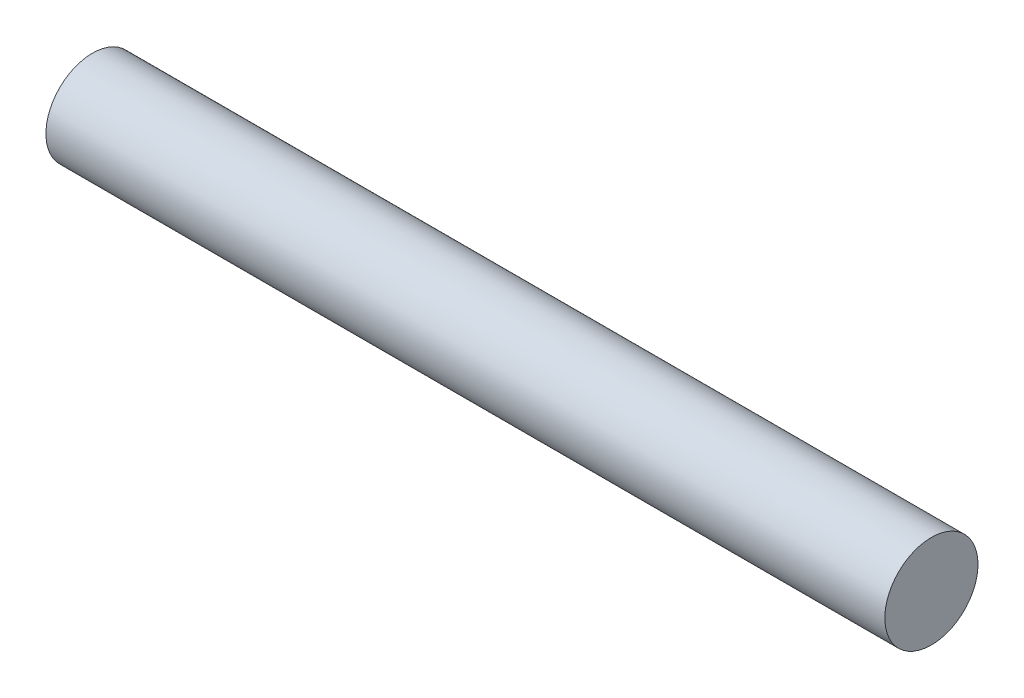
ISO-10303-21;
HEADER;
FILE_DESCRIPTION(('STEP AP214'),'2;1');
FILE_NAME('part.step','',(''),(''),'','','');
FILE_SCHEMA(('AUTOMOTIVE_DESIGN { 1 0 10303 214 1 1 1 1 }'));
ENDSEC;
DATA;
#1=APPLICATION_CONTEXT('core data for automotive mechanical design processes');
#2=APPLICATION_PROTOCOL_DEFINITION('international standard','automotive_design',2000,#1);
#3=PRODUCT_CONTEXT('',#1,'mechanical');
#4=PRODUCT('Part','Part','',(#3));
#5=PRODUCT_RELATED_PRODUCT_CATEGORY('part','',(#4));
#6=PRODUCT_DEFINITION_FORMATION('','',#4);
#7=PRODUCT_DEFINITION_CONTEXT('part definition',#1,'design');
#8=PRODUCT_DEFINITION('design','',#6,#7);
#9=PRODUCT_DEFINITION_SHAPE('','',#8);
#10=(LENGTH_UNIT() NAMED_UNIT(*) SI_UNIT(.MILLI.,.METRE.));
#11=(NAMED_UNIT(*) PLANE_ANGLE_UNIT() SI_UNIT($,.RADIAN.));
#12=(NAMED_UNIT(*) SI_UNIT($,.STERADIAN.) SOLID_ANGLE_UNIT());
#13=UNCERTAINTY_MEASURE_WITH_UNIT(LENGTH_MEASURE(1.E-05),#10,'distance_accuracy_value','');
#14=(GEOMETRIC_REPRESENTATION_CONTEXT(3) GLOBAL_UNCERTAINTY_ASSIGNED_CONTEXT((#13)) GLOBAL_UNIT_ASSIGNED_CONTEXT((#10,
#11,#12)) REPRESENTATION_CONTEXT('',''));
#15=CARTESIAN_POINT('',(0.,0.,0.));
#16=DIRECTION('',(0.,0.,1.));
#17=DIRECTION('',(1.,0.,0.));
#18=AXIS2_PLACEMENT_3D('',#15,#16,#17);
#19=CARTESIAN_POINT('',(180.,0.,0.));
#20=DIRECTION('',(-1.,0.,0.));
#21=DIRECTION('',(0.,0.,1.));
#22=AXIS2_PLACEMENT_3D('',#19,#20,#21);
#23=CYLINDRICAL_SURFACE('',#22,10.);
#24=CARTESIAN_POINT('',(180.,0.,0.));
#25=DIRECTION('',(1.,0.,0.));
#26=DIRECTION('',(0.,0.,-1.));
#27=AXIS2_PLACEMENT_3D('',#24,#25,#26);
#28=CIRCLE('',#27,10.);
#29=CARTESIAN_POINT('',(180.,0.,-10.));
#30=VERTEX_POINT('',#29);
#31=EDGE_CURVE('E10',#30,#30,#28,.T.);
#32=ORIENTED_EDGE('',*,*,#31,.F.);
#33=EDGE_LOOP('',(#32));
#34=FACE_BOUND('',#33,.T.);
#35=CARTESIAN_POINT('',(0.,0.,0.));
#36=DIRECTION('',(1.,0.,0.));
#37=DIRECTION('',(0.,0.,-1.));
#38=AXIS2_PLACEMENT_3D('',#35,#36,#37);
#39=CIRCLE('',#38,10.);
#40=CARTESIAN_POINT('',(0.,0.,-10.));
#41=VERTEX_POINT('',#40);
#42=EDGE_CURVE('E38',#41,#41,#39,.T.);
#43=ORIENTED_EDGE('',*,*,#42,.T.);
#44=EDGE_LOOP('',(#43));
#45=FACE_BOUND('',#44,.T.);
#46=ADVANCED_FACE('F35',(#34,#45),#23,.T.);
#47=CARTESIAN_POINT('',(180.,0.,0.));
#48=DIRECTION('',(1.,0.,0.));
#49=DIRECTION('',(0.,0.,-1.));
#50=AXIS2_PLACEMENT_3D('',#47,#48,#49);
#51=PLANE('',#50);
#52=ORIENTED_EDGE('',*,*,#31,.T.);
#53=EDGE_LOOP('',(#52));
#54=FACE_BOUND('',#53,.T.);
#55=ADVANCED_FACE('F50',(#54),#51,.T.);
#56=CARTESIAN_POINT('',(0.,0.,0.));
#57=DIRECTION('',(1.,0.,0.));
#58=DIRECTION('',(0.,0.,-1.));
#59=AXIS2_PLACEMENT_3D('',#56,#57,#58);
#60=PLANE('',#59);
#61=ORIENTED_EDGE('',*,*,#42,.F.);
#62=EDGE_LOOP('',(#61));
#63=FACE_BOUND('',#62,.T.);
#64=ADVANCED_FACE('F48',(#63),#60,.F.);
#65=CLOSED_SHELL('',(#46,#55,#64));
#66=MANIFOLD_SOLID_BREP('B2',#65);
#67=ADVANCED_BREP_SHAPE_REPRESENTATION('',(#18,#66),#14);
#68=SHAPE_DEFINITION_REPRESENTATION(#9,#67);
ENDSEC;
END-ISO-10303-21;
